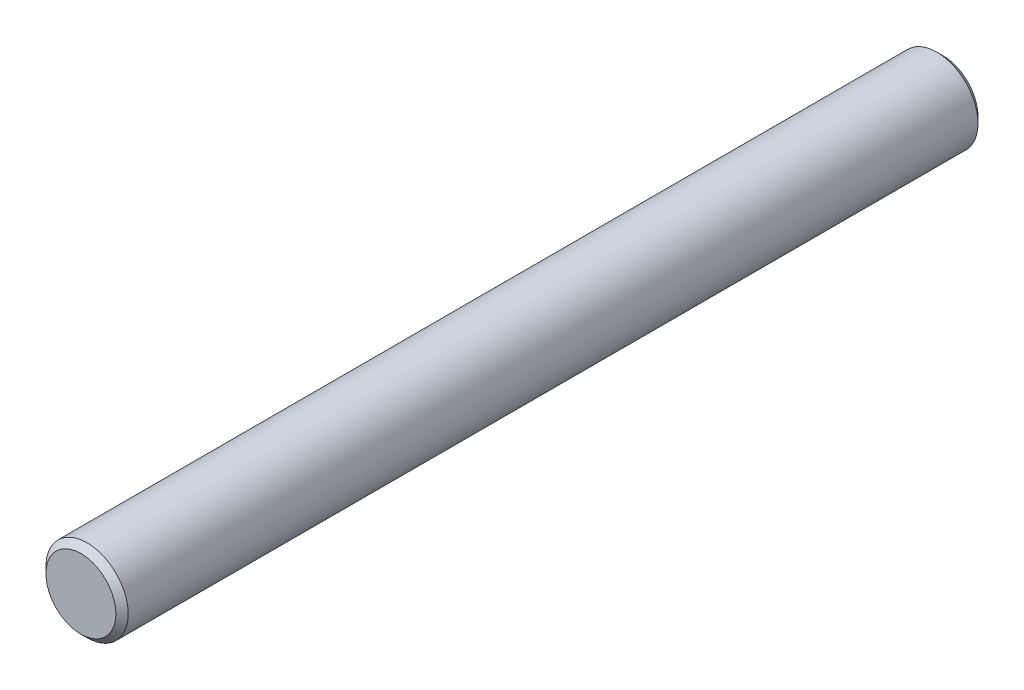
ISO-10303-21;
HEADER;
FILE_DESCRIPTION(('STEP AP214'),'2;1');
FILE_NAME('part.step','',(''),(''),'','','');
FILE_SCHEMA(('AUTOMOTIVE_DESIGN { 1 0 10303 214 1 1 1 1 }'));
ENDSEC;
DATA;
#1=APPLICATION_CONTEXT('core data for automotive mechanical design processes');
#2=APPLICATION_PROTOCOL_DEFINITION('international standard','automotive_design',2000,#1);
#3=PRODUCT_CONTEXT('',#1,'mechanical');
#4=PRODUCT('Part','Part','',(#3));
#5=PRODUCT_RELATED_PRODUCT_CATEGORY('part','',(#4));
#6=PRODUCT_DEFINITION_FORMATION('','',#4);
#7=PRODUCT_DEFINITION_CONTEXT('part definition',#1,'design');
#8=PRODUCT_DEFINITION('design','',#6,#7);
#9=PRODUCT_DEFINITION_SHAPE('','',#8);
#10=(LENGTH_UNIT() NAMED_UNIT(*) SI_UNIT(.MILLI.,.METRE.));
#11=(NAMED_UNIT(*) PLANE_ANGLE_UNIT() SI_UNIT($,.RADIAN.));
#12=(NAMED_UNIT(*) SI_UNIT($,.STERADIAN.) SOLID_ANGLE_UNIT());
#13=UNCERTAINTY_MEASURE_WITH_UNIT(LENGTH_MEASURE(1.E-05),#10,'distance_accuracy_value','');
#14=(GEOMETRIC_REPRESENTATION_CONTEXT(3) GLOBAL_UNCERTAINTY_ASSIGNED_CONTEXT((#13)) GLOBAL_UNIT_ASSIGNED_CONTEXT((#10,
#11,#12)) REPRESENTATION_CONTEXT('',''));
#15=CARTESIAN_POINT('',(0.,0.,0.));
#16=DIRECTION('',(0.,0.,1.));
#17=DIRECTION('',(1.,0.,0.));
#18=AXIS2_PLACEMENT_3D('',#15,#16,#17);
#19=CARTESIAN_POINT('',(0.,0.,41.5925));
#20=DIRECTION('',(0.,0.,-1.));
#21=DIRECTION('',(-1.,0.,0.));
#22=AXIS2_PLACEMENT_3D('',#19,#20,#21);
#23=CYLINDRICAL_SURFACE('',#22,3.96874999999989);
#24=CARTESIAN_POINT('',(0.,0.,-40.9971875));
#25=DIRECTION('',(0.,0.,1.));
#26=DIRECTION('',(1.,0.,0.));
#27=AXIS2_PLACEMENT_3D('',#24,#25,#26);
#28=CIRCLE('',#27,3.96874999999989);
#29=CARTESIAN_POINT('',(3.96874999999989,0.,-40.9971875));
#30=VERTEX_POINT('',#29);
#31=EDGE_CURVE('E44',#30,#30,#28,.T.);
#32=ORIENTED_EDGE('',*,*,#31,.T.);
#33=EDGE_LOOP('',(#32));
#34=FACE_BOUND('',#33,.T.);
#35=CARTESIAN_POINT('',(0.,0.,40.9971875));
#36=DIRECTION('',(0.,0.,1.));
#37=DIRECTION('',(1.,0.,0.));
#38=AXIS2_PLACEMENT_3D('',#35,#36,#37);
#39=CIRCLE('',#38,3.96874999999989);
#40=CARTESIAN_POINT('',(3.96874999999989,0.,40.9971875));
#41=VERTEX_POINT('',#40);
#42=EDGE_CURVE('E48',#41,#41,#39,.F.);
#43=ORIENTED_EDGE('',*,*,#42,.T.);
#44=EDGE_LOOP('',(#43));
#45=FACE_BOUND('',#44,.T.);
#46=ADVANCED_FACE('F33',(#34,#45),#23,.T.);
#47=CARTESIAN_POINT('',(0.,0.,41.5925));
#48=DIRECTION('',(0.,0.,1.));
#49=DIRECTION('',(1.,0.,0.));
#50=AXIS2_PLACEMENT_3D('',#47,#48,#49);
#51=PLANE('',#50);
#52=CARTESIAN_POINT('',(0.,0.,41.5925));
#53=DIRECTION('',(0.,0.,1.));
#54=DIRECTION('',(1.,0.,0.));
#55=AXIS2_PLACEMENT_3D('',#52,#53,#54);
#56=CIRCLE('',#55,3.37343749999989);
#57=CARTESIAN_POINT('',(3.37343749999989,0.,41.5925));
#58=VERTEX_POINT('',#57);
#59=EDGE_CURVE('E10',#58,#58,#56,.T.);
#60=ORIENTED_EDGE('',*,*,#59,.T.);
#61=EDGE_LOOP('',(#60));
#62=FACE_BOUND('',#61,.T.);
#63=ADVANCED_FACE('F64',(#62),#51,.T.);
#64=CARTESIAN_POINT('',(0.,0.,-41.5925));
#65=DIRECTION('',(0.,0.,1.));
#66=DIRECTION('',(1.,0.,0.));
#67=AXIS2_PLACEMENT_3D('',#64,#65,#66);
#68=PLANE('',#67);
#69=CARTESIAN_POINT('',(0.,0.,-41.5925));
#70=DIRECTION('',(0.,0.,1.));
#71=DIRECTION('',(1.,0.,0.));
#72=AXIS2_PLACEMENT_3D('',#69,#70,#71);
#73=CIRCLE('',#72,3.37343749999988);
#74=CARTESIAN_POINT('',(3.37343749999988,0.,-41.5925));
#75=VERTEX_POINT('',#74);
#76=EDGE_CURVE('E40',#75,#75,#73,.F.);
#77=ORIENTED_EDGE('',*,*,#76,.T.);
#78=EDGE_LOOP('',(#77));
#79=FACE_BOUND('',#78,.T.);
#80=ADVANCED_FACE('F61',(#79),#68,.F.);
#81=CARTESIAN_POINT('',(0.,0.,-40.9971875));
#82=DIRECTION('',(0.,0.,1.));
#83=DIRECTION('',(1.,0.,0.));
#84=AXIS2_PLACEMENT_3D('',#81,#82,#83);
#85=CONICAL_SURFACE('',#84,3.96874999999989,0.785398163397445);
#86=ORIENTED_EDGE('',*,*,#76,.F.);
#87=EDGE_LOOP('',(#86));
#88=FACE_BOUND('',#87,.T.);
#89=ORIENTED_EDGE('',*,*,#31,.F.);
#90=EDGE_LOOP('',(#89));
#91=FACE_BOUND('',#90,.T.);
#92=ADVANCED_FACE('F57',(#88,#91),#85,.T.);
#93=CARTESIAN_POINT('',(0.,0.,41.5925));
#94=DIRECTION('',(0.,0.,-1.));
#95=DIRECTION('',(-1.,0.,0.));
#96=AXIS2_PLACEMENT_3D('',#93,#94,#95);
#97=CONICAL_SURFACE('',#96,3.37343749999989,0.78539816339744);
#98=ORIENTED_EDGE('',*,*,#42,.F.);
#99=EDGE_LOOP('',(#98));
#100=FACE_BOUND('',#99,.T.);
#101=ORIENTED_EDGE('',*,*,#59,.F.);
#102=EDGE_LOOP('',(#101));
#103=FACE_BOUND('',#102,.T.);
#104=ADVANCED_FACE('F35',(#100,#103),#97,.T.);
#105=CLOSED_SHELL('',(#46,#63,#80,#92,#104));
#106=MANIFOLD_SOLID_BREP('B2',#105);
#107=ADVANCED_BREP_SHAPE_REPRESENTATION('',(#18,#106),#14);
#108=SHAPE_DEFINITION_REPRESENTATION(#9,#107);
ENDSEC;
END-ISO-10303-21;
